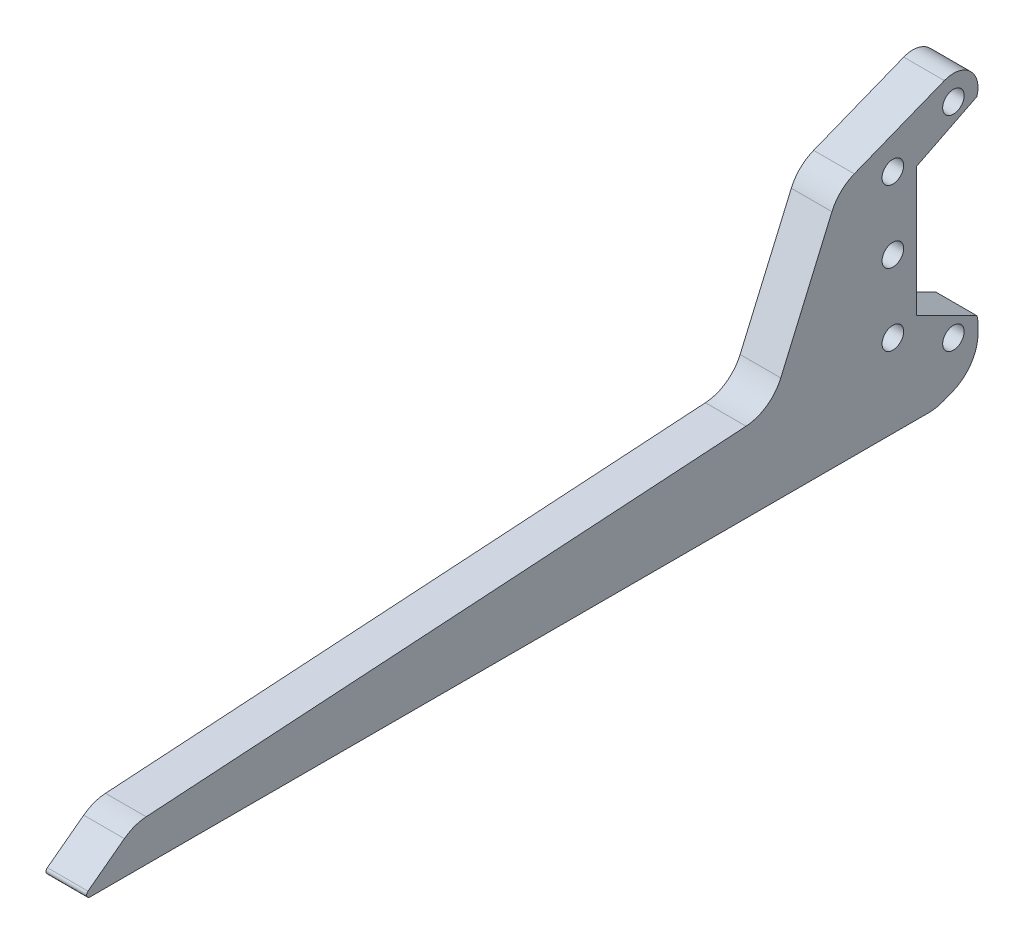
ISO-10303-21;
HEADER;
FILE_DESCRIPTION(('STEP AP214'),'2;1');
FILE_NAME('part.step','',(''),(''),'','','');
FILE_SCHEMA(('AUTOMOTIVE_DESIGN { 1 0 10303 214 1 1 1 1 }'));
ENDSEC;
DATA;
#1=APPLICATION_CONTEXT('core data for automotive mechanical design processes');
#2=APPLICATION_PROTOCOL_DEFINITION('international standard','automotive_design',2000,#1);
#3=PRODUCT_CONTEXT('',#1,'mechanical');
#4=PRODUCT('Part','Part','',(#3));
#5=PRODUCT_RELATED_PRODUCT_CATEGORY('part','',(#4));
#6=PRODUCT_DEFINITION_FORMATION('','',#4);
#7=PRODUCT_DEFINITION_CONTEXT('part definition',#1,'design');
#8=PRODUCT_DEFINITION('design','',#6,#7);
#9=PRODUCT_DEFINITION_SHAPE('','',#8);
#10=(LENGTH_UNIT() NAMED_UNIT(*) SI_UNIT(.MILLI.,.METRE.));
#11=(NAMED_UNIT(*) PLANE_ANGLE_UNIT() SI_UNIT($,.RADIAN.));
#12=(NAMED_UNIT(*) SI_UNIT($,.STERADIAN.) SOLID_ANGLE_UNIT());
#13=UNCERTAINTY_MEASURE_WITH_UNIT(LENGTH_MEASURE(1.E-05),#10,'distance_accuracy_value','');
#14=(GEOMETRIC_REPRESENTATION_CONTEXT(3) GLOBAL_UNCERTAINTY_ASSIGNED_CONTEXT((#13)) GLOBAL_UNIT_ASSIGNED_CONTEXT((#10,
#11,#12)) REPRESENTATION_CONTEXT('',''));
#15=CARTESIAN_POINT('',(0.,0.,0.));
#16=DIRECTION('',(0.,0.,1.));
#17=DIRECTION('',(1.,0.,0.));
#18=AXIS2_PLACEMENT_3D('',#15,#16,#17);
#19=CARTESIAN_POINT('',(-6.35,0.,0.));
#20=DIRECTION('',(1.,0.,0.));
#21=DIRECTION('',(0.,0.,-1.));
#22=AXIS2_PLACEMENT_3D('',#19,#20,#21);
#23=PLANE('',#22);
#24=DIRECTION('',(0.,0.,-1.));
#25=VECTOR('',#24,1.);
#26=CARTESIAN_POINT('',(-6.35,-72.5642126659781,497.205));
#27=LINE('',#26,#25);
#28=CARTESIAN_POINT('',(-6.35,-72.5642126659781,606.7425));
#29=VERTEX_POINT('',#28);
#30=CARTESIAN_POINT('',(-6.35,-72.564212665978,213.709546219237));
#31=VERTEX_POINT('',#30);
#32=EDGE_CURVE('E206',#29,#31,#27,.T.);
#33=ORIENTED_EDGE('',*,*,#32,.F.);
#34=CARTESIAN_POINT('',(-6.35,-70.9767126659781,606.7425));
#35=DIRECTION('',(1.,0.,0.));
#36=DIRECTION('',(0.,0.,-1.));
#37=AXIS2_PLACEMENT_3D('',#34,#35,#36);
#38=CIRCLE('',#37,1.5875);
#39=CARTESIAN_POINT('',(-6.35,-69.7067126659781,607.695));
#40=VERTEX_POINT('',#39);
#41=EDGE_CURVE('E11',#29,#40,#38,.F.);
#42=ORIENTED_EDGE('',*,*,#41,.T.);
#43=DIRECTION('',(0.,-0.600000000000001,0.799999999999999));
#44=VECTOR('',#43,1.);
#45=CARTESIAN_POINT('',(-6.35,-72.5642126659781,611.505));
#46=LINE('',#45,#44);
#47=CARTESIAN_POINT('',(-6.35,-56.9235634137904,590.650800997083));
#48=VERTEX_POINT('',#47);
#49=EDGE_CURVE('E316',#48,#40,#46,.T.);
#50=ORIENTED_EDGE('',*,*,#49,.F.);
#51=CARTESIAN_POINT('',(-6.35,-72.1635634137903,579.220800997083));
#52=DIRECTION('',(1.,0.,0.));
#53=DIRECTION('',(0.,0.,-1.));
#54=AXIS2_PLACEMENT_3D('',#51,#52,#53);
#55=CIRCLE('',#54,19.05);
#56=CARTESIAN_POINT('',(-6.35,-53.1522523852383,580.434288935076));
#57=VERTEX_POINT('',#56);
#58=EDGE_CURVE('E274',#48,#57,#55,.F.);
#59=ORIENTED_EDGE('',*,*,#58,.T.);
#60=DIRECTION('',(0.,-0.0637001542253379,0.997969082863627));
#61=VECTOR('',#60,1.);
#62=CARTESIAN_POINT('',(-6.35,-53.5142126659781,586.105));
#63=LINE('',#62,#61);
#64=CARTESIAN_POINT('',(-6.35,-35.2072856724961,299.296477102116));
#65=VERTEX_POINT('',#64);
#66=EDGE_CURVE('E334',#65,#57,#63,.T.);
#67=ORIENTED_EDGE('',*,*,#66,.F.);
#68=CARTESIAN_POINT('',(-6.35,-16.195974643944,300.509965040108));
#69=DIRECTION('',(1.,0.,0.));
#70=DIRECTION('',(0.,0.,-1.));
#71=AXIS2_PLACEMENT_3D('',#68,#69,#70);
#72=CIRCLE('',#71,19.05);
#73=CARTESIAN_POINT('',(-6.35,-23.757300716414,283.02486143659));
#74=VERTEX_POINT('',#73);
#75=EDGE_CURVE('E303',#65,#74,#72,.T.);
#76=ORIENTED_EDGE('',*,*,#75,.T.);
#77=DIRECTION('',(0.,-0.917853207533796,0.396920003804197));
#78=VECTOR('',#77,1.);
#79=CARTESIAN_POINT('',(-6.35,38.9557184533763,255.905));
#80=LINE('',#79,#78);
#81=CARTESIAN_POINT('',(-6.35,31.7142390854688,259.036533446378));
#82=VERTEX_POINT('',#81);
#83=EDGE_CURVE('E337',#82,#74,#80,.T.);
#84=ORIENTED_EDGE('',*,*,#83,.F.);
#85=CARTESIAN_POINT('',(-6.35,24.1529130129988,241.55142984286));
#86=DIRECTION('',(1.,0.,0.));
#87=DIRECTION('',(0.,0.,-1.));
#88=AXIS2_PLACEMENT_3D('',#85,#86,#87);
#89=CIRCLE('',#88,19.05);
#90=CARTESIAN_POINT('',(-6.35,41.8626679918143,248.570480960377));
#91=VERTEX_POINT('',#90);
#92=EDGE_CURVE('E276',#82,#91,#89,.F.);
#93=ORIENTED_EDGE('',*,*,#92,.T.);
#94=DIRECTION('',(0.,-0.368454126903789,0.929645930646484));
#95=VECTOR('',#94,1.);
#96=CARTESIAN_POINT('',(-6.35,121.322771421729,48.084839984891));
#97=LINE('',#96,#95);
#98=CARTESIAN_POINT('',(-6.35,58.5960620206366,206.35048522978));
#99=VERTEX_POINT('',#98);
#100=EDGE_CURVE('E186',#99,#91,#97,.T.);
#101=ORIENTED_EDGE('',*,*,#100,.F.);
#102=CARTESIAN_POINT('',(-6.35,47.8891724856854,202.106936685753));
#103=DIRECTION('',(1.,0.,0.));
#104=DIRECTION('',(0.,0.,-1.));
#105=AXIS2_PLACEMENT_3D('',#102,#103,#104);
#106=CIRCLE('',#105,11.5171692598122);
#107=CARTESIAN_POINT('',(-6.35,44.4432085147075,191.11737254199));
#108=VERTEX_POINT('',#107);
#109=EDGE_CURVE('E165',#108,#99,#106,.T.);
#110=ORIENTED_EDGE('',*,*,#109,.F.);
#111=DIRECTION('',(0.,-0.447213595499957,0.894427190999916));
#112=VECTOR('',#111,1.);
#113=CARTESIAN_POINT('',(-6.35,112.001515828562,56.0007579142808));
#114=LINE('',#113,#112);
#115=CARTESIAN_POINT('',(-6.35,30.3056447857023,219.3925));
#116=VERTEX_POINT('',#115);
#117=EDGE_CURVE('E176',#108,#116,#114,.T.);
#118=ORIENTED_EDGE('',*,*,#117,.T.);
#119=DIRECTION('',(0.,-1.,0.));
#120=VECTOR('',#119,1.);
#121=CARTESIAN_POINT('',(-6.35,0.,219.3925));
#122=LINE('',#121,#120);
#123=CARTESIAN_POINT('',(-6.35,-30.3056447857023,219.3925));
#124=VERTEX_POINT('',#123);
#125=EDGE_CURVE('E181',#116,#124,#122,.T.);
#126=ORIENTED_EDGE('',*,*,#125,.T.);
#127=DIRECTION('',(0.,-0.447213595499958,-0.894427190999916));
#128=VECTOR('',#127,1.);
#129=CARTESIAN_POINT('',(-6.35,-112.001515828562,56.0007579142809));
#130=LINE('',#129,#128);
#131=CARTESIAN_POINT('',(-6.35,-44.4432085147075,191.11737254199));
#132=VERTEX_POINT('',#131);
#133=EDGE_CURVE('E197',#124,#132,#130,.T.);
#134=ORIENTED_EDGE('',*,*,#133,.T.);
#135=CARTESIAN_POINT('',(-6.35,-47.8891724856855,202.106936685753));
#136=DIRECTION('',(1.,0.,0.));
#137=DIRECTION('',(0.,0.,-1.));
#138=AXIS2_PLACEMENT_3D('',#135,#136,#137);
#139=CIRCLE('',#138,11.5171692598121);
#140=CARTESIAN_POINT('',(-6.35,-47.8891724856855,190.589767425941));
#141=VERTEX_POINT('',#140);
#142=EDGE_CURVE('E200',#141,#132,#139,.T.);
#143=ORIENTED_EDGE('',*,*,#142,.F.);
#144=DIRECTION('',(0.,-1.,0.));
#145=VECTOR('',#144,1.);
#146=CARTESIAN_POINT('',(-6.35,0.,190.589767425941));
#147=LINE('',#146,#145);
#148=CARTESIAN_POINT('',(-6.35,-51.9012041618344,190.589767425941));
#149=VERTEX_POINT('',#148);
#150=EDGE_CURVE('E173',#141,#149,#147,.T.);
#151=ORIENTED_EDGE('',*,*,#150,.T.);
#152=CARTESIAN_POINT('',(-6.35,-51.9012041618344,209.639767425941));
#153=DIRECTION('',(1.,0.,0.));
#154=DIRECTION('',(0.,0.,-1.));
#155=AXIS2_PLACEMENT_3D('',#152,#153,#154);
#156=CIRCLE('',#155,19.05);
#157=CARTESIAN_POINT('',(-6.35,-69.6109591406499,202.620716308423));
#158=VERTEX_POINT('',#157);
#159=EDGE_CURVE('E281',#149,#158,#156,.F.);
#160=ORIENTED_EDGE('',*,*,#159,.T.);
#161=DIRECTION('',(0.,0.368454126903789,-0.929645930646483));
#162=VECTOR('',#161,1.);
#163=CARTESIAN_POINT('',(-6.35,-72.5642126659781,210.072064852297));
#164=LINE('',#163,#162);
#165=CARTESIAN_POINT('',(-6.35,-71.2239676447936,206.690495101719));
#166=VERTEX_POINT('',#165);
#167=EDGE_CURVE('E323',#166,#158,#164,.T.);
#168=ORIENTED_EDGE('',*,*,#167,.F.);
#169=CARTESIAN_POINT('',(-6.35,-53.5142126659781,213.709546219237));
#170=DIRECTION('',(1.,0.,0.));
#171=DIRECTION('',(0.,0.,-1.));
#172=AXIS2_PLACEMENT_3D('',#169,#170,#171);
#173=CIRCLE('',#172,19.05);
#174=EDGE_CURVE('E278',#166,#31,#173,.F.);
#175=ORIENTED_EDGE('',*,*,#174,.T.);
#176=EDGE_LOOP('',(#33,#42,#50,#59,#67,#76,#84,#93,#101,#110,#118,#126,#134,#143,#151,#160,#168,#175));
#177=FACE_BOUND('',#176,.T.);
#178=CARTESIAN_POINT('',(-6.35,-47.8891724856855,202.106936685753));
#179=DIRECTION('',(1.,0.,0.));
#180=DIRECTION('',(0.,0.,-1.));
#181=AXIS2_PLACEMENT_3D('',#178,#179,#180);
#182=CIRCLE('',#181,5.04189999999999);
#183=CARTESIAN_POINT('',(-6.35,-47.8891724856855,197.065036685753));
#184=VERTEX_POINT('',#183);
#185=EDGE_CURVE('E252',#184,#184,#182,.T.);
#186=ORIENTED_EDGE('',*,*,#185,.T.);
#187=EDGE_LOOP('',(#186));
#188=FACE_BOUND('',#187,.T.);
#189=CARTESIAN_POINT('',(-6.35,-33.6901408285617,230.505));
#190=DIRECTION('',(1.,0.,0.));
#191=DIRECTION('',(0.,0.,-1.));
#192=AXIS2_PLACEMENT_3D('',#189,#190,#191);
#193=CIRCLE('',#192,5.04189999999999);
#194=CARTESIAN_POINT('',(-6.35,-33.6901408285617,225.4631));
#195=VERTEX_POINT('',#194);
#196=EDGE_CURVE('E246',#195,#195,#193,.T.);
#197=ORIENTED_EDGE('',*,*,#196,.T.);
#198=EDGE_LOOP('',(#197));
#199=FACE_BOUND('',#198,.T.);
#200=CARTESIAN_POINT('',(-6.35,47.8891724856854,202.106936685753));
#201=DIRECTION('',(1.,0.,0.));
#202=DIRECTION('',(0.,0.,-1.));
#203=AXIS2_PLACEMENT_3D('',#200,#201,#202);
#204=CIRCLE('',#203,5.04189999999999);
#205=CARTESIAN_POINT('',(-6.35,47.8891724856854,197.065036685753));
#206=VERTEX_POINT('',#205);
#207=EDGE_CURVE('E240',#206,#206,#204,.T.);
#208=ORIENTED_EDGE('',*,*,#207,.T.);
#209=EDGE_LOOP('',(#208));
#210=FACE_BOUND('',#209,.T.);
#211=CARTESIAN_POINT('',(-6.35,33.6901408285618,230.505));
#212=DIRECTION('',(1.,0.,0.));
#213=DIRECTION('',(0.,0.,-1.));
#214=AXIS2_PLACEMENT_3D('',#211,#212,#213);
#215=CIRCLE('',#214,5.04189999999999);
#216=CARTESIAN_POINT('',(-6.35,33.6901408285618,225.4631));
#217=VERTEX_POINT('',#216);
#218=EDGE_CURVE('E234',#217,#217,#215,.T.);
#219=ORIENTED_EDGE('',*,*,#218,.T.);
#220=EDGE_LOOP('',(#219));
#221=FACE_BOUND('',#220,.T.);
#222=CARTESIAN_POINT('',(-6.35,1.11022302462516E-13,230.505));
#223=DIRECTION('',(1.,0.,0.));
#224=DIRECTION('',(0.,0.,-1.));
#225=AXIS2_PLACEMENT_3D('',#222,#223,#224);
#226=CIRCLE('',#225,5.04189999999999);
#227=CARTESIAN_POINT('',(-6.35,1.11022302462516E-13,225.4631));
#228=VERTEX_POINT('',#227);
#229=EDGE_CURVE('E228',#228,#228,#226,.T.);
#230=ORIENTED_EDGE('',*,*,#229,.T.);
#231=EDGE_LOOP('',(#230));
#232=FACE_BOUND('',#231,.T.);
#233=ADVANCED_FACE('F39',(#177,#188,#199,#210,#221,#232),#23,.F.);
#234=CARTESIAN_POINT('',(12.7,0.,0.));
#235=DIRECTION('',(1.,0.,0.));
#236=DIRECTION('',(0.,0.,-1.));
#237=AXIS2_PLACEMENT_3D('',#234,#235,#236);
#238=PLANE('',#237);
#239=DIRECTION('',(0.,-0.600000000000001,0.799999999999999));
#240=VECTOR('',#239,1.);
#241=CARTESIAN_POINT('',(12.7,-72.5642126659781,611.505));
#242=LINE('',#241,#240);
#243=CARTESIAN_POINT('',(12.7,-56.9235634137904,590.650800997083));
#244=VERTEX_POINT('',#243);
#245=CARTESIAN_POINT('',(12.7,-69.7067126659781,607.695));
#246=VERTEX_POINT('',#245);
#247=EDGE_CURVE('E313',#244,#246,#242,.T.);
#248=ORIENTED_EDGE('',*,*,#247,.T.);
#249=CARTESIAN_POINT('',(12.7,-70.9767126659781,606.7425));
#250=DIRECTION('',(1.,0.,0.));
#251=DIRECTION('',(0.,0.,-1.));
#252=AXIS2_PLACEMENT_3D('',#249,#250,#251);
#253=CIRCLE('',#252,1.5875);
#254=CARTESIAN_POINT('',(12.7,-72.5642126659781,606.7425));
#255=VERTEX_POINT('',#254);
#256=EDGE_CURVE('E61',#246,#255,#253,.T.);
#257=ORIENTED_EDGE('',*,*,#256,.T.);
#258=DIRECTION('',(0.,0.,-1.));
#259=VECTOR('',#258,1.);
#260=CARTESIAN_POINT('',(12.7,-72.5642126659781,490.855));
#261=LINE('',#260,#259);
#262=CARTESIAN_POINT('',(12.7,-72.5642126659781,213.709546219237));
#263=VERTEX_POINT('',#262);
#264=EDGE_CURVE('E193',#255,#263,#261,.T.);
#265=ORIENTED_EDGE('',*,*,#264,.T.);
#266=CARTESIAN_POINT('',(12.7,-53.5142126659781,213.709546219237));
#267=DIRECTION('',(1.,0.,0.));
#268=DIRECTION('',(0.,0.,-1.));
#269=AXIS2_PLACEMENT_3D('',#266,#267,#268);
#270=CIRCLE('',#269,19.05);
#271=CARTESIAN_POINT('',(12.7,-71.2239676447936,206.690495101719));
#272=VERTEX_POINT('',#271);
#273=EDGE_CURVE('E268',#263,#272,#270,.T.);
#274=ORIENTED_EDGE('',*,*,#273,.T.);
#275=DIRECTION('',(0.,0.368454126903789,-0.929645930646483));
#276=VECTOR('',#275,1.);
#277=CARTESIAN_POINT('',(12.7,-72.5642126659781,210.072064852297));
#278=LINE('',#277,#276);
#279=CARTESIAN_POINT('',(12.7,-69.6109591406499,202.620716308423));
#280=VERTEX_POINT('',#279);
#281=EDGE_CURVE('E329',#272,#280,#278,.T.);
#282=ORIENTED_EDGE('',*,*,#281,.T.);
#283=CARTESIAN_POINT('',(12.7,-51.9012041618344,209.639767425941));
#284=DIRECTION('',(1.,0.,0.));
#285=DIRECTION('',(0.,0.,-1.));
#286=AXIS2_PLACEMENT_3D('',#283,#284,#285);
#287=CIRCLE('',#286,19.05);
#288=CARTESIAN_POINT('',(12.7,-51.9012041618344,190.589767425941));
#289=VERTEX_POINT('',#288);
#290=EDGE_CURVE('E270',#280,#289,#287,.T.);
#291=ORIENTED_EDGE('',*,*,#290,.T.);
#292=DIRECTION('',(0.,-1.,0.));
#293=VECTOR('',#292,1.);
#294=CARTESIAN_POINT('',(12.7,0.,190.589767425941));
#295=LINE('',#294,#293);
#296=CARTESIAN_POINT('',(12.7,-47.8891724856855,190.589767425941));
#297=VERTEX_POINT('',#296);
#298=EDGE_CURVE('E187',#297,#289,#295,.T.);
#299=ORIENTED_EDGE('',*,*,#298,.F.);
#300=CARTESIAN_POINT('',(12.7,-47.8891724856855,202.106936685753));
#301=DIRECTION('',(1.,0.,0.));
#302=DIRECTION('',(0.,0.,-1.));
#303=AXIS2_PLACEMENT_3D('',#300,#301,#302);
#304=CIRCLE('',#303,11.5171692598121);
#305=CARTESIAN_POINT('',(12.7,-44.4432085147075,191.11737254199));
#306=VERTEX_POINT('',#305);
#307=EDGE_CURVE('E190',#297,#306,#304,.T.);
#308=ORIENTED_EDGE('',*,*,#307,.T.);
#309=DIRECTION('',(0.,-0.447213595499958,-0.894427190999916));
#310=VECTOR('',#309,1.);
#311=CARTESIAN_POINT('',(12.7,-112.001515828562,56.0007579142809));
#312=LINE('',#311,#310);
#313=CARTESIAN_POINT('',(12.7,-30.3056447857023,219.3925));
#314=VERTEX_POINT('',#313);
#315=EDGE_CURVE('E211',#314,#306,#312,.T.);
#316=ORIENTED_EDGE('',*,*,#315,.F.);
#317=DIRECTION('',(0.,-1.,0.));
#318=VECTOR('',#317,1.);
#319=CARTESIAN_POINT('',(12.7,0.,219.3925));
#320=LINE('',#319,#318);
#321=CARTESIAN_POINT('',(12.7,30.3056447857023,219.3925));
#322=VERTEX_POINT('',#321);
#323=EDGE_CURVE('E208',#322,#314,#320,.T.);
#324=ORIENTED_EDGE('',*,*,#323,.F.);
#325=DIRECTION('',(0.,-0.447213595499957,0.894427190999916));
#326=VECTOR('',#325,1.);
#327=CARTESIAN_POINT('',(12.7,112.001515828562,56.0007579142808));
#328=LINE('',#327,#326);
#329=CARTESIAN_POINT('',(12.7,44.4432085147075,191.11737254199));
#330=VERTEX_POINT('',#329);
#331=EDGE_CURVE('E205',#330,#322,#328,.T.);
#332=ORIENTED_EDGE('',*,*,#331,.F.);
#333=CARTESIAN_POINT('',(12.7,47.8891724856854,202.106936685753));
#334=DIRECTION('',(1.,0.,0.));
#335=DIRECTION('',(0.,0.,-1.));
#336=AXIS2_PLACEMENT_3D('',#333,#334,#335);
#337=CIRCLE('',#336,11.5171692598122);
#338=CARTESIAN_POINT('',(12.7,58.5960620206366,206.35048522978));
#339=VERTEX_POINT('',#338);
#340=EDGE_CURVE('E168',#330,#339,#337,.T.);
#341=ORIENTED_EDGE('',*,*,#340,.T.);
#342=DIRECTION('',(0.,-0.368454126903789,0.929645930646484));
#343=VECTOR('',#342,1.);
#344=CARTESIAN_POINT('',(12.7,121.322771421729,48.084839984891));
#345=LINE('',#344,#343);
#346=CARTESIAN_POINT('',(12.7,41.8626679918143,248.570480960377));
#347=VERTEX_POINT('',#346);
#348=EDGE_CURVE('E255',#339,#347,#345,.T.);
#349=ORIENTED_EDGE('',*,*,#348,.T.);
#350=CARTESIAN_POINT('',(12.7,24.1529130129988,241.55142984286));
#351=DIRECTION('',(1.,0.,0.));
#352=DIRECTION('',(0.,0.,-1.));
#353=AXIS2_PLACEMENT_3D('',#350,#351,#352);
#354=CIRCLE('',#353,19.05);
#355=CARTESIAN_POINT('',(12.7,31.7142390854688,259.036533446378));
#356=VERTEX_POINT('',#355);
#357=EDGE_CURVE('E266',#347,#356,#354,.T.);
#358=ORIENTED_EDGE('',*,*,#357,.T.);
#359=DIRECTION('',(0.,-0.917853207533796,0.396920003804197));
#360=VECTOR('',#359,1.);
#361=CARTESIAN_POINT('',(12.7,38.9557184533763,255.905));
#362=LINE('',#361,#360);
#363=CARTESIAN_POINT('',(12.7,-23.757300716414,283.02486143659));
#364=VERTEX_POINT('',#363);
#365=EDGE_CURVE('E324',#356,#364,#362,.T.);
#366=ORIENTED_EDGE('',*,*,#365,.T.);
#367=CARTESIAN_POINT('',(12.7,-16.195974643944,300.509965040108));
#368=DIRECTION('',(1.,0.,0.));
#369=DIRECTION('',(0.,0.,-1.));
#370=AXIS2_PLACEMENT_3D('',#367,#368,#369);
#371=CIRCLE('',#370,19.05);
#372=CARTESIAN_POINT('',(12.7,-35.2072856724961,299.296477102116));
#373=VERTEX_POINT('',#372);
#374=EDGE_CURVE('E301',#364,#373,#371,.F.);
#375=ORIENTED_EDGE('',*,*,#374,.T.);
#376=DIRECTION('',(0.,-0.0637001542253379,0.997969082863627));
#377=VECTOR('',#376,1.);
#378=CARTESIAN_POINT('',(12.7,-53.5142126659781,586.105));
#379=LINE('',#378,#377);
#380=CARTESIAN_POINT('',(12.7,-53.1522523852383,580.434288935076));
#381=VERTEX_POINT('',#380);
#382=EDGE_CURVE('E322',#373,#381,#379,.T.);
#383=ORIENTED_EDGE('',*,*,#382,.T.);
#384=CARTESIAN_POINT('',(12.7,-72.1635634137903,579.220800997083));
#385=DIRECTION('',(1.,0.,0.));
#386=DIRECTION('',(0.,0.,-1.));
#387=AXIS2_PLACEMENT_3D('',#384,#385,#386);
#388=CIRCLE('',#387,19.05);
#389=EDGE_CURVE('E264',#381,#244,#388,.T.);
#390=ORIENTED_EDGE('',*,*,#389,.T.);
#391=EDGE_LOOP('',(#248,#257,#265,#274,#282,#291,#299,#308,#316,#324,#332,#341,#349,#358,#366,
#375,#383,#390));
#392=FACE_BOUND('',#391,.T.);
#393=CARTESIAN_POINT('',(12.7,-47.8891724856855,202.106936685753));
#394=DIRECTION('',(1.,0.,0.));
#395=DIRECTION('',(0.,0.,-1.));
#396=AXIS2_PLACEMENT_3D('',#393,#394,#395);
#397=CIRCLE('',#396,5.04189999999999);
#398=CARTESIAN_POINT('',(12.7,-47.8891724856855,197.065036685753));
#399=VERTEX_POINT('',#398);
#400=EDGE_CURVE('E249',#399,#399,#397,.T.);
#401=ORIENTED_EDGE('',*,*,#400,.F.);
#402=EDGE_LOOP('',(#401));
#403=FACE_BOUND('',#402,.T.);
#404=CARTESIAN_POINT('',(12.7,-33.6901408285617,230.505));
#405=DIRECTION('',(1.,0.,0.));
#406=DIRECTION('',(0.,0.,-1.));
#407=AXIS2_PLACEMENT_3D('',#404,#405,#406);
#408=CIRCLE('',#407,5.04189999999999);
#409=CARTESIAN_POINT('',(12.7,-33.6901408285617,225.4631));
#410=VERTEX_POINT('',#409);
#411=EDGE_CURVE('E243',#410,#410,#408,.T.);
#412=ORIENTED_EDGE('',*,*,#411,.F.);
#413=EDGE_LOOP('',(#412));
#414=FACE_BOUND('',#413,.T.);
#415=CARTESIAN_POINT('',(12.7,47.8891724856854,202.106936685753));
#416=DIRECTION('',(1.,0.,0.));
#417=DIRECTION('',(0.,0.,-1.));
#418=AXIS2_PLACEMENT_3D('',#415,#416,#417);
#419=CIRCLE('',#418,5.04189999999999);
#420=CARTESIAN_POINT('',(12.7,47.8891724856854,197.065036685753));
#421=VERTEX_POINT('',#420);
#422=EDGE_CURVE('E237',#421,#421,#419,.T.);
#423=ORIENTED_EDGE('',*,*,#422,.F.);
#424=EDGE_LOOP('',(#423));
#425=FACE_BOUND('',#424,.T.);
#426=CARTESIAN_POINT('',(12.7,33.6901408285618,230.505));
#427=DIRECTION('',(1.,0.,0.));
#428=DIRECTION('',(0.,0.,-1.));
#429=AXIS2_PLACEMENT_3D('',#426,#427,#428);
#430=CIRCLE('',#429,5.04189999999999);
#431=CARTESIAN_POINT('',(12.7,33.6901408285618,225.4631));
#432=VERTEX_POINT('',#431);
#433=EDGE_CURVE('E231',#432,#432,#430,.T.);
#434=ORIENTED_EDGE('',*,*,#433,.F.);
#435=EDGE_LOOP('',(#434));
#436=FACE_BOUND('',#435,.T.);
#437=CARTESIAN_POINT('',(12.7,1.11022302462516E-13,230.505));
#438=DIRECTION('',(1.,0.,0.));
#439=DIRECTION('',(0.,0.,-1.));
#440=AXIS2_PLACEMENT_3D('',#437,#438,#439);
#441=CIRCLE('',#440,5.04189999999999);
#442=CARTESIAN_POINT('',(12.7,1.11022302462516E-13,225.4631));
#443=VERTEX_POINT('',#442);
#444=EDGE_CURVE('E218',#443,#443,#441,.T.);
#445=ORIENTED_EDGE('',*,*,#444,.F.);
#446=EDGE_LOOP('',(#445));
#447=FACE_BOUND('',#446,.T.);
#448=ADVANCED_FACE('F319',(#392,#403,#414,#425,#436,#447),#238,.T.);
#449=CARTESIAN_POINT('',(-6.35,121.322771421729,48.084839984891));
#450=DIRECTION('',(0.,0.929645930646483,0.368454126903789));
#451=DIRECTION('',(0.,-0.368454126903789,0.929645930646484));
#452=AXIS2_PLACEMENT_3D('',#449,#450,#451);
#453=PLANE('',#452);
#454=ORIENTED_EDGE('',*,*,#100,.T.);
#455=DIRECTION('',(1.,0.,0.));
#456=VECTOR('',#455,1.);
#457=CARTESIAN_POINT('',(-6.35,41.8626679918143,248.570480960377));
#458=LINE('',#457,#456);
#459=EDGE_CURVE('E286',#91,#347,#458,.T.);
#460=ORIENTED_EDGE('',*,*,#459,.T.);
#461=ORIENTED_EDGE('',*,*,#348,.F.);
#462=DIRECTION('',(1.,0.,0.));
#463=VECTOR('',#462,1.);
#464=CARTESIAN_POINT('',(-6.35,58.5960620206366,206.35048522978));
#465=LINE('',#464,#463);
#466=EDGE_CURVE('E216',#99,#339,#465,.T.);
#467=ORIENTED_EDGE('',*,*,#466,.F.);
#468=EDGE_LOOP('',(#454,#460,#461,#467));
#469=FACE_BOUND('',#468,.T.);
#470=ADVANCED_FACE('F370',(#469),#453,.T.);
#471=CARTESIAN_POINT('',(12.7,-47.8891724856855,202.106936685753));
#472=DIRECTION('',(1.,0.,0.));
#473=DIRECTION('',(0.,0.,-1.));
#474=AXIS2_PLACEMENT_3D('',#471,#472,#473);
#475=CYLINDRICAL_SURFACE('',#474,5.04189999999999);
#476=ORIENTED_EDGE('',*,*,#185,.F.);
#477=EDGE_LOOP('',(#476));
#478=FACE_BOUND('',#477,.T.);
#479=ORIENTED_EDGE('',*,*,#400,.T.);
#480=EDGE_LOOP('',(#479));
#481=FACE_BOUND('',#480,.T.);
#482=ADVANCED_FACE('F404',(#478,#481),#475,.F.);
#483=CARTESIAN_POINT('',(12.7,-33.6901408285617,230.505));
#484=DIRECTION('',(1.,0.,0.));
#485=DIRECTION('',(0.,0.,-1.));
#486=AXIS2_PLACEMENT_3D('',#483,#484,#485);
#487=CYLINDRICAL_SURFACE('',#486,5.04189999999999);
#488=ORIENTED_EDGE('',*,*,#196,.F.);
#489=EDGE_LOOP('',(#488));
#490=FACE_BOUND('',#489,.T.);
#491=ORIENTED_EDGE('',*,*,#411,.T.);
#492=EDGE_LOOP('',(#491));
#493=FACE_BOUND('',#492,.T.);
#494=ADVANCED_FACE('F526',(#490,#493),#487,.F.);
#495=CARTESIAN_POINT('',(12.7,47.8891724856854,202.106936685753));
#496=DIRECTION('',(1.,0.,0.));
#497=DIRECTION('',(0.,0.,-1.));
#498=AXIS2_PLACEMENT_3D('',#495,#496,#497);
#499=CYLINDRICAL_SURFACE('',#498,5.04189999999999);
#500=ORIENTED_EDGE('',*,*,#207,.F.);
#501=EDGE_LOOP('',(#500));
#502=FACE_BOUND('',#501,.T.);
#503=ORIENTED_EDGE('',*,*,#422,.T.);
#504=EDGE_LOOP('',(#503));
#505=FACE_BOUND('',#504,.T.);
#506=ADVANCED_FACE('F523',(#502,#505),#499,.F.);
#507=CARTESIAN_POINT('',(12.7,33.6901408285618,230.505));
#508=DIRECTION('',(1.,0.,0.));
#509=DIRECTION('',(0.,0.,-1.));
#510=AXIS2_PLACEMENT_3D('',#507,#508,#509);
#511=CYLINDRICAL_SURFACE('',#510,5.04189999999999);
#512=ORIENTED_EDGE('',*,*,#218,.F.);
#513=EDGE_LOOP('',(#512));
#514=FACE_BOUND('',#513,.T.);
#515=ORIENTED_EDGE('',*,*,#433,.T.);
#516=EDGE_LOOP('',(#515));
#517=FACE_BOUND('',#516,.T.);
#518=ADVANCED_FACE('F519',(#514,#517),#511,.F.);
#519=CARTESIAN_POINT('',(12.7,1.11022302462516E-13,230.505));
#520=DIRECTION('',(1.,0.,0.));
#521=DIRECTION('',(0.,0.,-1.));
#522=AXIS2_PLACEMENT_3D('',#519,#520,#521);
#523=CYLINDRICAL_SURFACE('',#522,5.04189999999999);
#524=ORIENTED_EDGE('',*,*,#229,.F.);
#525=EDGE_LOOP('',(#524));
#526=FACE_BOUND('',#525,.T.);
#527=ORIENTED_EDGE('',*,*,#444,.T.);
#528=EDGE_LOOP('',(#527));
#529=FACE_BOUND('',#528,.T.);
#530=ADVANCED_FACE('F516',(#526,#529),#523,.F.);
#531=CARTESIAN_POINT('',(-6.35,47.8891724856854,202.106936685753));
#532=DIRECTION('',(1.,0.,0.));
#533=DIRECTION('',(0.,0.,-1.));
#534=AXIS2_PLACEMENT_3D('',#531,#532,#533);
#535=CYLINDRICAL_SURFACE('',#534,11.5171692598122);
#536=ORIENTED_EDGE('',*,*,#340,.F.);
#537=DIRECTION('',(1.,0.,0.));
#538=VECTOR('',#537,1.);
#539=CARTESIAN_POINT('',(-6.35,44.4432085147075,191.11737254199));
#540=LINE('',#539,#538);
#541=EDGE_CURVE('E161',#108,#330,#540,.T.);
#542=ORIENTED_EDGE('',*,*,#541,.F.);
#543=ORIENTED_EDGE('',*,*,#109,.T.);
#544=ORIENTED_EDGE('',*,*,#466,.T.);
#545=EDGE_LOOP('',(#536,#542,#543,#544));
#546=FACE_BOUND('',#545,.T.);
#547=ADVANCED_FACE('F163',(#546),#535,.T.);
#548=CARTESIAN_POINT('',(-6.35,0.,190.589767425941));
#549=DIRECTION('',(0.,0.,1.));
#550=DIRECTION('',(1.,0.,0.));
#551=AXIS2_PLACEMENT_3D('',#548,#549,#550);
#552=PLANE('',#551);
#553=ORIENTED_EDGE('',*,*,#298,.T.);
#554=DIRECTION('',(1.,0.,0.));
#555=VECTOR('',#554,1.);
#556=CARTESIAN_POINT('',(-6.35,-51.9012041618344,190.589767425941));
#557=LINE('',#556,#555);
#558=EDGE_CURVE('E272',#289,#149,#557,.F.);
#559=ORIENTED_EDGE('',*,*,#558,.T.);
#560=ORIENTED_EDGE('',*,*,#150,.F.);
#561=DIRECTION('',(1.,0.,0.));
#562=VECTOR('',#561,1.);
#563=CARTESIAN_POINT('',(-6.35,-47.8891724856855,190.589767425941));
#564=LINE('',#563,#562);
#565=EDGE_CURVE('E219',#141,#297,#564,.T.);
#566=ORIENTED_EDGE('',*,*,#565,.T.);
#567=EDGE_LOOP('',(#553,#559,#560,#566));
#568=FACE_BOUND('',#567,.T.);
#569=ADVANCED_FACE('F354',(#568),#552,.F.);
#570=CARTESIAN_POINT('',(-6.35,-47.8891724856855,202.106936685753));
#571=DIRECTION('',(1.,0.,0.));
#572=DIRECTION('',(0.,0.,-1.));
#573=AXIS2_PLACEMENT_3D('',#570,#571,#572);
#574=CYLINDRICAL_SURFACE('',#573,11.5171692598121);
#575=ORIENTED_EDGE('',*,*,#307,.F.);
#576=ORIENTED_EDGE('',*,*,#565,.F.);
#577=ORIENTED_EDGE('',*,*,#142,.T.);
#578=DIRECTION('',(1.,0.,0.));
#579=VECTOR('',#578,1.);
#580=CARTESIAN_POINT('',(-6.35,-44.4432085147075,191.11737254199));
#581=LINE('',#580,#579);
#582=EDGE_CURVE('E221',#132,#306,#581,.T.);
#583=ORIENTED_EDGE('',*,*,#582,.T.);
#584=EDGE_LOOP('',(#575,#576,#577,#583));
#585=FACE_BOUND('',#584,.T.);
#586=ADVANCED_FACE('F359',(#585),#574,.T.);
#587=CARTESIAN_POINT('',(-6.35,-112.001515828562,56.0007579142809));
#588=DIRECTION('',(0.,-0.894427190999916,0.447213595499958));
#589=DIRECTION('',(0.,-0.447213595499958,-0.894427190999916));
#590=AXIS2_PLACEMENT_3D('',#587,#588,#589);
#591=PLANE('',#590);
#592=ORIENTED_EDGE('',*,*,#315,.T.);
#593=ORIENTED_EDGE('',*,*,#582,.F.);
#594=ORIENTED_EDGE('',*,*,#133,.F.);
#595=DIRECTION('',(1.,0.,0.));
#596=VECTOR('',#595,1.);
#597=CARTESIAN_POINT('',(-6.35,-30.3056447857023,219.3925));
#598=LINE('',#597,#596);
#599=EDGE_CURVE('E223',#124,#314,#598,.T.);
#600=ORIENTED_EDGE('',*,*,#599,.T.);
#601=EDGE_LOOP('',(#592,#593,#594,#600));
#602=FACE_BOUND('',#601,.T.);
#603=ADVANCED_FACE('F364',(#602),#591,.F.);
#604=CARTESIAN_POINT('',(-6.35,0.,219.3925));
#605=DIRECTION('',(0.,0.,1.));
#606=DIRECTION('',(1.,0.,0.));
#607=AXIS2_PLACEMENT_3D('',#604,#605,#606);
#608=PLANE('',#607);
#609=ORIENTED_EDGE('',*,*,#323,.T.);
#610=ORIENTED_EDGE('',*,*,#599,.F.);
#611=ORIENTED_EDGE('',*,*,#125,.F.);
#612=DIRECTION('',(1.,0.,0.));
#613=VECTOR('',#612,1.);
#614=CARTESIAN_POINT('',(-6.35,30.3056447857023,219.3925));
#615=LINE('',#614,#613);
#616=EDGE_CURVE('E172',#116,#322,#615,.T.);
#617=ORIENTED_EDGE('',*,*,#616,.T.);
#618=EDGE_LOOP('',(#609,#610,#611,#617));
#619=FACE_BOUND('',#618,.T.);
#620=ADVANCED_FACE('F367',(#619),#608,.F.);
#621=CARTESIAN_POINT('',(-6.35,112.001515828562,56.0007579142808));
#622=DIRECTION('',(0.,0.894427190999916,0.447213595499957));
#623=DIRECTION('',(0.,-0.447213595499958,0.894427190999916));
#624=AXIS2_PLACEMENT_3D('',#621,#622,#623);
#625=PLANE('',#624);
#626=ORIENTED_EDGE('',*,*,#331,.T.);
#627=ORIENTED_EDGE('',*,*,#616,.F.);
#628=ORIENTED_EDGE('',*,*,#117,.F.);
#629=ORIENTED_EDGE('',*,*,#541,.T.);
#630=EDGE_LOOP('',(#626,#627,#628,#629));
#631=FACE_BOUND('',#630,.T.);
#632=ADVANCED_FACE('F177',(#631),#625,.F.);
#633=CARTESIAN_POINT('',(-6.35,-72.5642126659781,210.072064852297));
#634=DIRECTION('',(0.,-0.929645930646483,-0.368454126903789));
#635=DIRECTION('',(0.,0.368454126903789,-0.929645930646483));
#636=AXIS2_PLACEMENT_3D('',#633,#634,#635);
#637=PLANE('',#636);
#638=ORIENTED_EDGE('',*,*,#167,.T.);
#639=DIRECTION('',(1.,0.,0.));
#640=VECTOR('',#639,1.);
#641=CARTESIAN_POINT('',(12.7,-69.6109591406499,202.620716308423));
#642=LINE('',#641,#640);
#643=EDGE_CURVE('E261',#158,#280,#642,.T.);
#644=ORIENTED_EDGE('',*,*,#643,.T.);
#645=ORIENTED_EDGE('',*,*,#281,.F.);
#646=DIRECTION('',(1.,0.,0.));
#647=VECTOR('',#646,1.);
#648=CARTESIAN_POINT('',(-6.35,-71.2239676447936,206.690495101719));
#649=LINE('',#648,#647);
#650=EDGE_CURVE('E257',#272,#166,#649,.F.);
#651=ORIENTED_EDGE('',*,*,#650,.T.);
#652=EDGE_LOOP('',(#638,#644,#645,#651));
#653=FACE_BOUND('',#652,.T.);
#654=ADVANCED_FACE('F344',(#653),#637,.T.);
#655=CARTESIAN_POINT('',(-6.35,-72.5642126659781,490.855));
#656=DIRECTION('',(0.,-1.,0.));
#657=DIRECTION('',(0.,0.,-1.));
#658=AXIS2_PLACEMENT_3D('',#655,#656,#657);
#659=PLANE('',#658);
#660=ORIENTED_EDGE('',*,*,#264,.F.);
#661=DIRECTION('',(1.,0.,0.));
#662=VECTOR('',#661,1.);
#663=CARTESIAN_POINT('',(-6.35,-72.5642126659781,606.7425));
#664=LINE('',#663,#662);
#665=EDGE_CURVE('E47',#255,#29,#664,.F.);
#666=ORIENTED_EDGE('',*,*,#665,.T.);
#667=ORIENTED_EDGE('',*,*,#32,.T.);
#668=DIRECTION('',(1.,0.,0.));
#669=VECTOR('',#668,1.);
#670=CARTESIAN_POINT('',(-6.35,-72.5642126659781,213.709546219237));
#671=LINE('',#670,#669);
#672=EDGE_CURVE('E283',#31,#263,#671,.T.);
#673=ORIENTED_EDGE('',*,*,#672,.T.);
#674=EDGE_LOOP('',(#660,#666,#667,#673));
#675=FACE_BOUND('',#674,.T.);
#676=ADVANCED_FACE('F446',(#675),#659,.T.);
#677=CARTESIAN_POINT('',(-6.35,-72.5642126659781,611.505));
#678=DIRECTION('',(0.,0.799999999999999,0.600000000000001));
#679=DIRECTION('',(0.,-0.600000000000001,0.799999999999999));
#680=AXIS2_PLACEMENT_3D('',#677,#678,#679);
#681=PLANE('',#680);
#682=ORIENTED_EDGE('',*,*,#49,.T.);
#683=DIRECTION('',(1.,0.,0.));
#684=VECTOR('',#683,1.);
#685=CARTESIAN_POINT('',(-6.35,-69.7067126659781,607.695));
#686=LINE('',#685,#684);
#687=EDGE_CURVE('E305',#40,#246,#686,.T.);
#688=ORIENTED_EDGE('',*,*,#687,.T.);
#689=ORIENTED_EDGE('',*,*,#247,.F.);
#690=DIRECTION('',(1.,0.,0.));
#691=VECTOR('',#690,1.);
#692=CARTESIAN_POINT('',(-6.35,-56.9235634137904,590.650800997083));
#693=LINE('',#692,#691);
#694=EDGE_CURVE('E299',#244,#48,#693,.F.);
#695=ORIENTED_EDGE('',*,*,#694,.T.);
#696=EDGE_LOOP('',(#682,#688,#689,#695));
#697=FACE_BOUND('',#696,.T.);
#698=ADVANCED_FACE('F312',(#697),#681,.T.);
#699=CARTESIAN_POINT('',(-6.35,-53.5142126659781,586.105));
#700=DIRECTION('',(0.,0.997969082863627,0.0637001542253379));
#701=DIRECTION('',(0.,-0.0637001542253379,0.997969082863627));
#702=AXIS2_PLACEMENT_3D('',#699,#700,#701);
#703=PLANE('',#702);
#704=ORIENTED_EDGE('',*,*,#382,.F.);
#705=DIRECTION('',(1.,0.,0.));
#706=VECTOR('',#705,1.);
#707=CARTESIAN_POINT('',(-6.35,-35.2072856724961,299.296477102116));
#708=LINE('',#707,#706);
#709=EDGE_CURVE('E297',#373,#65,#708,.F.);
#710=ORIENTED_EDGE('',*,*,#709,.T.);
#711=ORIENTED_EDGE('',*,*,#66,.T.);
#712=DIRECTION('',(1.,0.,0.));
#713=VECTOR('',#712,1.);
#714=CARTESIAN_POINT('',(-6.35,-53.1522523852383,580.434288935076));
#715=LINE('',#714,#713);
#716=EDGE_CURVE('E294',#57,#381,#715,.T.);
#717=ORIENTED_EDGE('',*,*,#716,.T.);
#718=EDGE_LOOP('',(#704,#710,#711,#717));
#719=FACE_BOUND('',#718,.T.);
#720=ADVANCED_FACE('F387',(#719),#703,.T.);
#721=CARTESIAN_POINT('',(-6.35,38.9557184533763,255.905));
#722=DIRECTION('',(0.,0.396920003804197,0.917853207533796));
#723=DIRECTION('',(0.,-0.917853207533796,0.396920003804197));
#724=AXIS2_PLACEMENT_3D('',#721,#722,#723);
#725=PLANE('',#724);
#726=ORIENTED_EDGE('',*,*,#365,.F.);
#727=DIRECTION('',(1.,0.,0.));
#728=VECTOR('',#727,1.);
#729=CARTESIAN_POINT('',(-6.35,31.7142390854688,259.036533446378));
#730=LINE('',#729,#728);
#731=EDGE_CURVE('E292',#356,#82,#730,.F.);
#732=ORIENTED_EDGE('',*,*,#731,.T.);
#733=ORIENTED_EDGE('',*,*,#83,.T.);
#734=DIRECTION('',(1.,0.,0.));
#735=VECTOR('',#734,1.);
#736=CARTESIAN_POINT('',(12.7,-23.757300716414,283.02486143659));
#737=LINE('',#736,#735);
#738=EDGE_CURVE('E289',#74,#364,#737,.T.);
#739=ORIENTED_EDGE('',*,*,#738,.T.);
#740=EDGE_LOOP('',(#726,#732,#733,#739));
#741=FACE_BOUND('',#740,.T.);
#742=ADVANCED_FACE('F378',(#741),#725,.T.);
#743=CARTESIAN_POINT('',(-6.35,-51.9012041618344,209.639767425941));
#744=DIRECTION('',(-1.,0.,0.));
#745=DIRECTION('',(0.,0.,1.));
#746=AXIS2_PLACEMENT_3D('',#743,#744,#745);
#747=CYLINDRICAL_SURFACE('',#746,19.05);
#748=ORIENTED_EDGE('',*,*,#159,.F.);
#749=ORIENTED_EDGE('',*,*,#558,.F.);
#750=ORIENTED_EDGE('',*,*,#290,.F.);
#751=ORIENTED_EDGE('',*,*,#643,.F.);
#752=EDGE_LOOP('',(#748,#749,#750,#751));
#753=FACE_BOUND('',#752,.T.);
#754=ADVANCED_FACE('F350',(#753),#747,.T.);
#755=CARTESIAN_POINT('',(-6.35,-53.5142126659781,213.709546219237));
#756=DIRECTION('',(1.,0.,0.));
#757=DIRECTION('',(0.,0.,-1.));
#758=AXIS2_PLACEMENT_3D('',#755,#756,#757);
#759=CYLINDRICAL_SURFACE('',#758,19.05);
#760=ORIENTED_EDGE('',*,*,#174,.F.);
#761=ORIENTED_EDGE('',*,*,#650,.F.);
#762=ORIENTED_EDGE('',*,*,#273,.F.);
#763=ORIENTED_EDGE('',*,*,#672,.F.);
#764=EDGE_LOOP('',(#760,#761,#762,#763));
#765=FACE_BOUND('',#764,.T.);
#766=ADVANCED_FACE('F411',(#765),#759,.T.);
#767=CARTESIAN_POINT('',(-6.35,24.1529130129988,241.55142984286));
#768=DIRECTION('',(1.,0.,0.));
#769=DIRECTION('',(0.,0.,-1.));
#770=AXIS2_PLACEMENT_3D('',#767,#768,#769);
#771=CYLINDRICAL_SURFACE('',#770,19.05);
#772=ORIENTED_EDGE('',*,*,#92,.F.);
#773=ORIENTED_EDGE('',*,*,#731,.F.);
#774=ORIENTED_EDGE('',*,*,#357,.F.);
#775=ORIENTED_EDGE('',*,*,#459,.F.);
#776=EDGE_LOOP('',(#772,#773,#774,#775));
#777=FACE_BOUND('',#776,.T.);
#778=ADVANCED_FACE('F374',(#777),#771,.T.);
#779=CARTESIAN_POINT('',(-6.35,-16.195974643944,300.509965040108));
#780=DIRECTION('',(-1.,0.,0.));
#781=DIRECTION('',(0.,0.,1.));
#782=AXIS2_PLACEMENT_3D('',#779,#780,#781);
#783=CYLINDRICAL_SURFACE('',#782,19.05);
#784=ORIENTED_EDGE('',*,*,#75,.F.);
#785=ORIENTED_EDGE('',*,*,#709,.F.);
#786=ORIENTED_EDGE('',*,*,#374,.F.);
#787=ORIENTED_EDGE('',*,*,#738,.F.);
#788=EDGE_LOOP('',(#784,#785,#786,#787));
#789=FACE_BOUND('',#788,.T.);
#790=ADVANCED_FACE('F383',(#789),#783,.F.);
#791=CARTESIAN_POINT('',(-6.35,-72.1635634137903,579.220800997083));
#792=DIRECTION('',(1.,0.,0.));
#793=DIRECTION('',(0.,0.,-1.));
#794=AXIS2_PLACEMENT_3D('',#791,#792,#793);
#795=CYLINDRICAL_SURFACE('',#794,19.05);
#796=ORIENTED_EDGE('',*,*,#58,.F.);
#797=ORIENTED_EDGE('',*,*,#694,.F.);
#798=ORIENTED_EDGE('',*,*,#389,.F.);
#799=ORIENTED_EDGE('',*,*,#716,.F.);
#800=EDGE_LOOP('',(#796,#797,#798,#799));
#801=FACE_BOUND('',#800,.T.);
#802=ADVANCED_FACE('F392',(#801),#795,.T.);
#803=CARTESIAN_POINT('',(-6.35,-70.9767126659781,606.7425));
#804=DIRECTION('',(1.,0.,0.));
#805=DIRECTION('',(0.,0.,-1.));
#806=AXIS2_PLACEMENT_3D('',#803,#804,#805);
#807=CYLINDRICAL_SURFACE('',#806,1.5875);
#808=ORIENTED_EDGE('',*,*,#41,.F.);
#809=ORIENTED_EDGE('',*,*,#665,.F.);
#810=ORIENTED_EDGE('',*,*,#256,.F.);
#811=ORIENTED_EDGE('',*,*,#687,.F.);
#812=EDGE_LOOP('',(#808,#809,#810,#811));
#813=FACE_BOUND('',#812,.T.);
#814=ADVANCED_FACE('F41',(#813),#807,.T.);
#815=CLOSED_SHELL('',(#233,#448,#470,#482,#494,#506,#518,#530,#547,#569,#586,#603,#620,#632,
#654,#676,#698,#720,#742,#754,#766,#778,#790,#802,#814));
#816=MANIFOLD_SOLID_BREP('B2',#815);
#817=ADVANCED_BREP_SHAPE_REPRESENTATION('',(#18,#816),#14);
#818=SHAPE_DEFINITION_REPRESENTATION(#9,#817);
ENDSEC;
END-ISO-10303-21;
